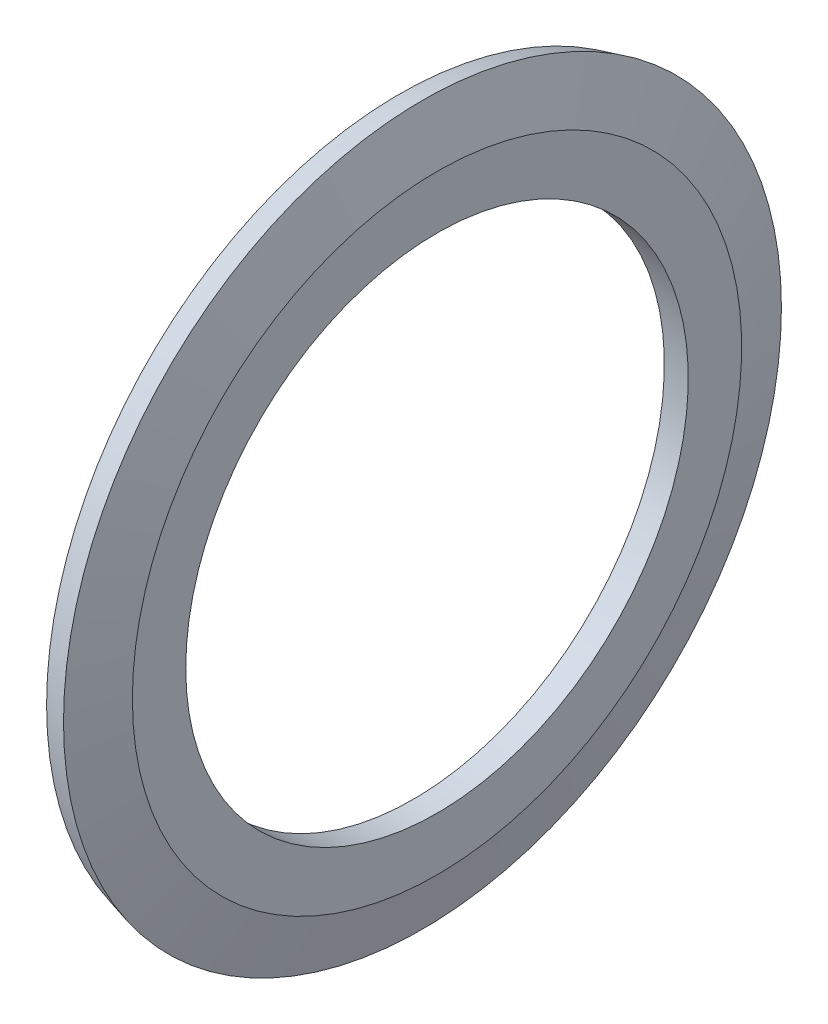
ISO-10303-21;
HEADER;
FILE_DESCRIPTION(('STEP AP214'),'2;1');
FILE_NAME('part.step','',(''),(''),'','','');
FILE_SCHEMA(('AUTOMOTIVE_DESIGN { 1 0 10303 214 1 1 1 1 }'));
ENDSEC;
DATA;
#1=APPLICATION_CONTEXT('core data for automotive mechanical design processes');
#2=APPLICATION_PROTOCOL_DEFINITION('international standard','automotive_design',2000,#1);
#3=PRODUCT_CONTEXT('',#1,'mechanical');
#4=PRODUCT('Part','Part','',(#3));
#5=PRODUCT_RELATED_PRODUCT_CATEGORY('part','',(#4));
#6=PRODUCT_DEFINITION_FORMATION('','',#4);
#7=PRODUCT_DEFINITION_CONTEXT('part definition',#1,'design');
#8=PRODUCT_DEFINITION('design','',#6,#7);
#9=PRODUCT_DEFINITION_SHAPE('','',#8);
#10=(LENGTH_UNIT() NAMED_UNIT(*) SI_UNIT(.MILLI.,.METRE.));
#11=(NAMED_UNIT(*) PLANE_ANGLE_UNIT() SI_UNIT($,.RADIAN.));
#12=(NAMED_UNIT(*) SI_UNIT($,.STERADIAN.) SOLID_ANGLE_UNIT());
#13=UNCERTAINTY_MEASURE_WITH_UNIT(LENGTH_MEASURE(1.E-05),#10,'distance_accuracy_value','');
#14=(GEOMETRIC_REPRESENTATION_CONTEXT(3) GLOBAL_UNCERTAINTY_ASSIGNED_CONTEXT((#13)) GLOBAL_UNIT_ASSIGNED_CONTEXT((#10,
#11,#12)) REPRESENTATION_CONTEXT('',''));
#15=CARTESIAN_POINT('',(0.,0.,0.));
#16=DIRECTION('',(0.,0.,1.));
#17=DIRECTION('',(1.,0.,0.));
#18=AXIS2_PLACEMENT_3D('',#15,#16,#17);
#19=CARTESIAN_POINT('',(0.,0.,0.));
#20=DIRECTION('',(-1.,0.,0.));
#21=DIRECTION('',(0.,0.,1.));
#22=AXIS2_PLACEMENT_3D('',#19,#20,#21);
#23=CYLINDRICAL_SURFACE('',#22,10.5);
#24=CARTESIAN_POINT('',(0.999999999999998,0.,0.));
#25=DIRECTION('',(-1.,0.,0.));
#26=DIRECTION('',(0.,0.,1.));
#27=AXIS2_PLACEMENT_3D('',#24,#25,#26);
#28=CIRCLE('',#27,10.5);
#29=CARTESIAN_POINT('',(0.999999999999998,0.,10.5));
#30=VERTEX_POINT('',#29);
#31=EDGE_CURVE('E10',#30,#30,#28,.T.);
#32=ORIENTED_EDGE('',*,*,#31,.F.);
#33=EDGE_LOOP('',(#32));
#34=FACE_BOUND('',#33,.T.);
#35=CARTESIAN_POINT('',(0.,0.,0.));
#36=DIRECTION('',(-1.,0.,0.));
#37=DIRECTION('',(0.,0.,1.));
#38=AXIS2_PLACEMENT_3D('',#35,#36,#37);
#39=CIRCLE('',#38,10.5);
#40=CARTESIAN_POINT('',(0.,0.,10.5));
#41=VERTEX_POINT('',#40);
#42=EDGE_CURVE('E61',#41,#41,#39,.T.);
#43=ORIENTED_EDGE('',*,*,#42,.T.);
#44=EDGE_LOOP('',(#43));
#45=FACE_BOUND('',#44,.T.);
#46=ADVANCED_FACE('F33',(#34,#45),#23,.F.);
#47=CARTESIAN_POINT('',(0.999999999999999,10.5,0.));
#48=DIRECTION('',(-1.,0.,0.));
#49=DIRECTION('',(0.,0.,1.));
#50=AXIS2_PLACEMENT_3D('',#47,#48,#49);
#51=PLANE('',#50);
#52=CARTESIAN_POINT('',(1.,0.,0.));
#53=DIRECTION('',(-1.,0.,0.));
#54=DIRECTION('',(0.,0.,1.));
#55=AXIS2_PLACEMENT_3D('',#52,#53,#54);
#56=CIRCLE('',#55,12.73);
#57=CARTESIAN_POINT('',(1.,0.,12.73));
#58=VERTEX_POINT('',#57);
#59=EDGE_CURVE('E40',#58,#58,#56,.T.);
#60=ORIENTED_EDGE('',*,*,#59,.F.);
#61=EDGE_LOOP('',(#60));
#62=FACE_BOUND('',#61,.T.);
#63=ORIENTED_EDGE('',*,*,#31,.T.);
#64=EDGE_LOOP('',(#63));
#65=FACE_BOUND('',#64,.T.);
#66=ADVANCED_FACE('F86',(#62,#65),#51,.F.);
#67=CARTESIAN_POINT('',(1.,0.,0.));
#68=DIRECTION('',(-1.,0.,0.));
#69=DIRECTION('',(0.,0.,1.));
#70=AXIS2_PLACEMENT_3D('',#67,#68,#69);
#71=CONICAL_SURFACE('',#70,12.73,1.30899693899575);
#72=CARTESIAN_POINT('',(0.391755333181349,0.,0.));
#73=DIRECTION('',(-1.,0.,0.));
#74=DIRECTION('',(0.,0.,1.));
#75=AXIS2_PLACEMENT_3D('',#72,#73,#74);
#76=CIRCLE('',#75,15.);
#77=CARTESIAN_POINT('',(0.391755333181349,0.,15.));
#78=VERTEX_POINT('',#77);
#79=EDGE_CURVE('E46',#78,#78,#76,.T.);
#80=ORIENTED_EDGE('',*,*,#79,.F.);
#81=EDGE_LOOP('',(#80));
#82=FACE_BOUND('',#81,.T.);
#83=ORIENTED_EDGE('',*,*,#59,.T.);
#84=EDGE_LOOP('',(#83));
#85=FACE_BOUND('',#84,.T.);
#86=ADVANCED_FACE('F81',(#82,#85),#71,.T.);
#87=CARTESIAN_POINT('',(0.391755333181349,0.,0.));
#88=DIRECTION('',(1.,0.,0.));
#89=DIRECTION('',(0.,0.,-1.));
#90=AXIS2_PLACEMENT_3D('',#87,#88,#89);
#91=CONICAL_SURFACE('',#90,15.,0.261799387799151);
#92=CARTESIAN_POINT('',(-0.574170493107719,0.,0.));
#93=DIRECTION('',(-1.,0.,0.));
#94=DIRECTION('',(0.,0.,1.));
#95=AXIS2_PLACEMENT_3D('',#92,#93,#94);
#96=CIRCLE('',#95,14.7411809548975);
#97=CARTESIAN_POINT('',(-0.574170493107719,0.,14.7411809548975));
#98=VERTEX_POINT('',#97);
#99=EDGE_CURVE('E51',#98,#98,#96,.T.);
#100=ORIENTED_EDGE('',*,*,#99,.F.);
#101=EDGE_LOOP('',(#100));
#102=FACE_BOUND('',#101,.T.);
#103=ORIENTED_EDGE('',*,*,#79,.T.);
#104=EDGE_LOOP('',(#103));
#105=FACE_BOUND('',#104,.T.);
#106=ADVANCED_FACE('F75',(#102,#105),#91,.T.);
#107=CARTESIAN_POINT('',(-0.574170493107719,0.,0.));
#108=DIRECTION('',(-1.,0.,0.));
#109=DIRECTION('',(0.,0.,1.));
#110=AXIS2_PLACEMENT_3D('',#107,#108,#109);
#111=CONICAL_SURFACE('',#110,14.7411809548975,1.30899693899575);
#112=CARTESIAN_POINT('',(0.,0.,0.));
#113=DIRECTION('',(-1.,0.,0.));
#114=DIRECTION('',(0.,0.,1.));
#115=AXIS2_PLACEMENT_3D('',#112,#113,#114);
#116=CIRCLE('',#115,12.5983475024126);
#117=CARTESIAN_POINT('',(0.,0.,12.5983475024126));
#118=VERTEX_POINT('',#117);
#119=EDGE_CURVE('E57',#118,#118,#116,.T.);
#120=ORIENTED_EDGE('',*,*,#119,.F.);
#121=EDGE_LOOP('',(#120));
#122=FACE_BOUND('',#121,.T.);
#123=ORIENTED_EDGE('',*,*,#99,.T.);
#124=EDGE_LOOP('',(#123));
#125=FACE_BOUND('',#124,.T.);
#126=ADVANCED_FACE('F69',(#122,#125),#111,.F.);
#127=CARTESIAN_POINT('',(0.,10.5,0.));
#128=DIRECTION('',(1.,0.,0.));
#129=DIRECTION('',(0.,0.,-1.));
#130=AXIS2_PLACEMENT_3D('',#127,#128,#129);
#131=PLANE('',#130);
#132=ORIENTED_EDGE('',*,*,#42,.F.);
#133=EDGE_LOOP('',(#132));
#134=FACE_BOUND('',#133,.T.);
#135=ORIENTED_EDGE('',*,*,#119,.T.);
#136=EDGE_LOOP('',(#135));
#137=FACE_BOUND('',#136,.T.);
#138=ADVANCED_FACE('F66',(#134,#137),#131,.F.);
#139=CLOSED_SHELL('',(#46,#66,#86,#106,#126,#138));
#140=MANIFOLD_SOLID_BREP('B2',#139);
#141=ADVANCED_BREP_SHAPE_REPRESENTATION('',(#18,#140),#14);
#142=SHAPE_DEFINITION_REPRESENTATION(#9,#141);
ENDSEC;
END-ISO-10303-21;
